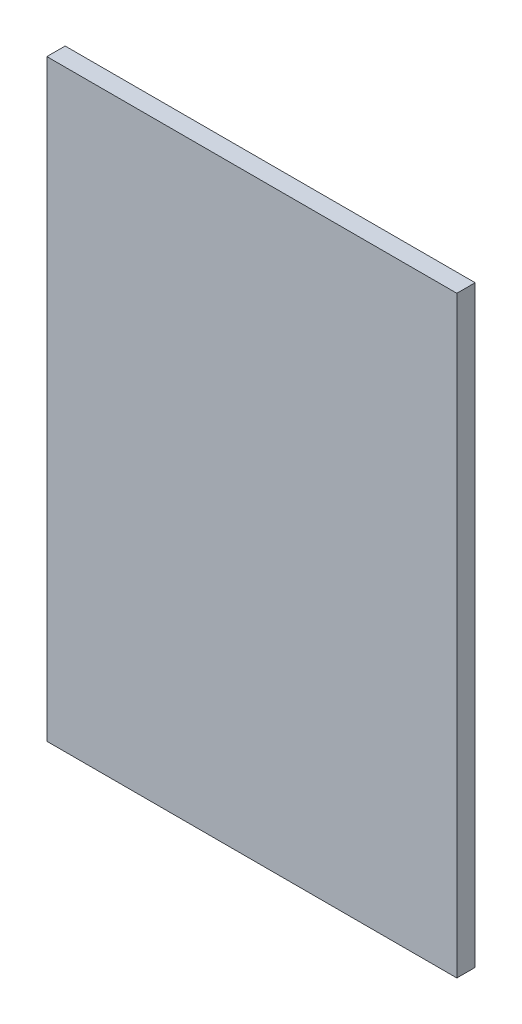
ISO-10303-21;
HEADER;
FILE_DESCRIPTION(('STEP AP214'),'2;1');
FILE_NAME('part.step','',(''),(''),'','','');
FILE_SCHEMA(('AUTOMOTIVE_DESIGN { 1 0 10303 214 1 1 1 1 }'));
ENDSEC;
DATA;
#1=APPLICATION_CONTEXT('core data for automotive mechanical design processes');
#2=APPLICATION_PROTOCOL_DEFINITION('international standard','automotive_design',2000,#1);
#3=PRODUCT_CONTEXT('',#1,'mechanical');
#4=PRODUCT('Part','Part','',(#3));
#5=PRODUCT_RELATED_PRODUCT_CATEGORY('part','',(#4));
#6=PRODUCT_DEFINITION_FORMATION('','',#4);
#7=PRODUCT_DEFINITION_CONTEXT('part definition',#1,'design');
#8=PRODUCT_DEFINITION('design','',#6,#7);
#9=PRODUCT_DEFINITION_SHAPE('','',#8);
#10=(LENGTH_UNIT() NAMED_UNIT(*) SI_UNIT(.MILLI.,.METRE.));
#11=(NAMED_UNIT(*) PLANE_ANGLE_UNIT() SI_UNIT($,.RADIAN.));
#12=(NAMED_UNIT(*) SI_UNIT($,.STERADIAN.) SOLID_ANGLE_UNIT());
#13=UNCERTAINTY_MEASURE_WITH_UNIT(LENGTH_MEASURE(1.E-05),#10,'distance_accuracy_value','');
#14=(GEOMETRIC_REPRESENTATION_CONTEXT(3) GLOBAL_UNCERTAINTY_ASSIGNED_CONTEXT((#13)) GLOBAL_UNIT_ASSIGNED_CONTEXT((#10,
#11,#12)) REPRESENTATION_CONTEXT('',''));
#15=CARTESIAN_POINT('',(0.,0.,0.));
#16=DIRECTION('',(0.,0.,1.));
#17=DIRECTION('',(1.,0.,0.));
#18=AXIS2_PLACEMENT_3D('',#15,#16,#17);
#19=CARTESIAN_POINT('',(56.896,0.,2.54));
#20=DIRECTION('',(0.,1.,0.));
#21=DIRECTION('',(0.,0.,1.));
#22=AXIS2_PLACEMENT_3D('',#19,#20,#21);
#23=PLANE('',#22);
#24=DIRECTION('',(1.,0.,0.));
#25=VECTOR('',#24,1.);
#26=CARTESIAN_POINT('',(56.896,0.,0.));
#27=LINE('',#26,#25);
#28=CARTESIAN_POINT('',(0.,0.,0.));
#29=VERTEX_POINT('',#28);
#30=CARTESIAN_POINT('',(56.896,0.,0.));
#31=VERTEX_POINT('',#30);
#32=EDGE_CURVE('E111',#29,#31,#27,.T.);
#33=ORIENTED_EDGE('',*,*,#32,.T.);
#34=DIRECTION('',(0.,0.,-1.));
#35=VECTOR('',#34,1.);
#36=CARTESIAN_POINT('',(56.896,0.,2.54));
#37=LINE('',#36,#35);
#38=CARTESIAN_POINT('',(56.896,0.,2.54));
#39=VERTEX_POINT('',#38);
#40=EDGE_CURVE('E11',#39,#31,#37,.T.);
#41=ORIENTED_EDGE('',*,*,#40,.F.);
#42=DIRECTION('',(1.,0.,0.));
#43=VECTOR('',#42,1.);
#44=CARTESIAN_POINT('',(56.896,0.,2.54));
#45=LINE('',#44,#43);
#46=CARTESIAN_POINT('',(0.,0.,2.54));
#47=VERTEX_POINT('',#46);
#48=EDGE_CURVE('E95',#47,#39,#45,.T.);
#49=ORIENTED_EDGE('',*,*,#48,.F.);
#50=DIRECTION('',(0.,0.,-1.));
#51=VECTOR('',#50,1.);
#52=CARTESIAN_POINT('',(0.,0.,2.54));
#53=LINE('',#52,#51);
#54=EDGE_CURVE('E107',#47,#29,#53,.T.);
#55=ORIENTED_EDGE('',*,*,#54,.T.);
#56=EDGE_LOOP('',(#33,#41,#49,#55));
#57=FACE_BOUND('',#56,.T.);
#58=ADVANCED_FACE('F43',(#57),#23,.F.);
#59=CARTESIAN_POINT('',(56.896,82.296,2.54));
#60=DIRECTION('',(-1.,0.,0.));
#61=DIRECTION('',(0.,0.,1.));
#62=AXIS2_PLACEMENT_3D('',#59,#60,#61);
#63=PLANE('',#62);
#64=DIRECTION('',(0.,1.,0.));
#65=VECTOR('',#64,1.);
#66=CARTESIAN_POINT('',(56.896,82.296,0.));
#67=LINE('',#66,#65);
#68=CARTESIAN_POINT('',(56.896,82.296,0.));
#69=VERTEX_POINT('',#68);
#70=EDGE_CURVE('E100',#31,#69,#67,.T.);
#71=ORIENTED_EDGE('',*,*,#70,.T.);
#72=DIRECTION('',(0.,0.,-1.));
#73=VECTOR('',#72,1.);
#74=CARTESIAN_POINT('',(56.896,82.296,2.54));
#75=LINE('',#74,#73);
#76=CARTESIAN_POINT('',(56.896,82.296,2.54));
#77=VERTEX_POINT('',#76);
#78=EDGE_CURVE('E52',#77,#69,#75,.T.);
#79=ORIENTED_EDGE('',*,*,#78,.F.);
#80=DIRECTION('',(0.,1.,0.));
#81=VECTOR('',#80,1.);
#82=CARTESIAN_POINT('',(56.896,82.296,2.54));
#83=LINE('',#82,#81);
#84=EDGE_CURVE('E90',#39,#77,#83,.T.);
#85=ORIENTED_EDGE('',*,*,#84,.F.);
#86=ORIENTED_EDGE('',*,*,#40,.T.);
#87=EDGE_LOOP('',(#71,#79,#85,#86));
#88=FACE_BOUND('',#87,.T.);
#89=ADVANCED_FACE('F99',(#88),#63,.F.);
#90=CARTESIAN_POINT('',(0.,82.296,2.54));
#91=DIRECTION('',(0.,-1.,0.));
#92=DIRECTION('',(0.,0.,-1.));
#93=AXIS2_PLACEMENT_3D('',#90,#91,#92);
#94=PLANE('',#93);
#95=DIRECTION('',(-1.,0.,0.));
#96=VECTOR('',#95,1.);
#97=CARTESIAN_POINT('',(0.,82.296,0.));
#98=LINE('',#97,#96);
#99=CARTESIAN_POINT('',(0.,82.296,0.));
#100=VERTEX_POINT('',#99);
#101=EDGE_CURVE('E77',#69,#100,#98,.T.);
#102=ORIENTED_EDGE('',*,*,#101,.T.);
#103=DIRECTION('',(0.,0.,-1.));
#104=VECTOR('',#103,1.);
#105=CARTESIAN_POINT('',(0.,82.296,2.54));
#106=LINE('',#105,#104);
#107=CARTESIAN_POINT('',(0.,82.296,2.54));
#108=VERTEX_POINT('',#107);
#109=EDGE_CURVE('E102',#108,#100,#106,.T.);
#110=ORIENTED_EDGE('',*,*,#109,.F.);
#111=DIRECTION('',(-1.,0.,0.));
#112=VECTOR('',#111,1.);
#113=CARTESIAN_POINT('',(0.,82.296,2.54));
#114=LINE('',#113,#112);
#115=EDGE_CURVE('E93',#77,#108,#114,.T.);
#116=ORIENTED_EDGE('',*,*,#115,.F.);
#117=ORIENTED_EDGE('',*,*,#78,.T.);
#118=EDGE_LOOP('',(#102,#110,#116,#117));
#119=FACE_BOUND('',#118,.T.);
#120=ADVANCED_FACE('F103',(#119),#94,.F.);
#121=CARTESIAN_POINT('',(0.,0.,2.54));
#122=DIRECTION('',(1.,0.,0.));
#123=DIRECTION('',(0.,0.,-1.));
#124=AXIS2_PLACEMENT_3D('',#121,#122,#123);
#125=PLANE('',#124);
#126=DIRECTION('',(0.,-1.,0.));
#127=VECTOR('',#126,1.);
#128=CARTESIAN_POINT('',(0.,0.,0.));
#129=LINE('',#128,#127);
#130=EDGE_CURVE('E83',#100,#29,#129,.T.);
#131=ORIENTED_EDGE('',*,*,#130,.T.);
#132=ORIENTED_EDGE('',*,*,#54,.F.);
#133=DIRECTION('',(0.,-1.,0.));
#134=VECTOR('',#133,1.);
#135=CARTESIAN_POINT('',(0.,0.,2.54));
#136=LINE('',#135,#134);
#137=EDGE_CURVE('E60',#108,#47,#136,.T.);
#138=ORIENTED_EDGE('',*,*,#137,.F.);
#139=ORIENTED_EDGE('',*,*,#109,.T.);
#140=EDGE_LOOP('',(#131,#132,#138,#139));
#141=FACE_BOUND('',#140,.T.);
#142=ADVANCED_FACE('F124',(#141),#125,.F.);
#143=CARTESIAN_POINT('',(0.,0.,2.54));
#144=DIRECTION('',(0.,0.,-1.));
#145=DIRECTION('',(-1.,0.,0.));
#146=AXIS2_PLACEMENT_3D('',#143,#144,#145);
#147=PLANE('',#146);
#148=ORIENTED_EDGE('',*,*,#48,.T.);
#149=ORIENTED_EDGE('',*,*,#84,.T.);
#150=ORIENTED_EDGE('',*,*,#115,.T.);
#151=ORIENTED_EDGE('',*,*,#137,.T.);
#152=EDGE_LOOP('',(#148,#149,#150,#151));
#153=FACE_BOUND('',#152,.T.);
#154=ADVANCED_FACE('F91',(#153),#147,.F.);
#155=CARTESIAN_POINT('',(0.,0.,0.));
#156=DIRECTION('',(0.,0.,-1.));
#157=DIRECTION('',(-1.,0.,0.));
#158=AXIS2_PLACEMENT_3D('',#155,#156,#157);
#159=PLANE('',#158);
#160=ORIENTED_EDGE('',*,*,#32,.F.);
#161=ORIENTED_EDGE('',*,*,#130,.F.);
#162=ORIENTED_EDGE('',*,*,#101,.F.);
#163=ORIENTED_EDGE('',*,*,#70,.F.);
#164=EDGE_LOOP('',(#160,#161,#162,#163));
#165=FACE_BOUND('',#164,.T.);
#166=ADVANCED_FACE('F127',(#165),#159,.T.);
#167=CLOSED_SHELL('',(#58,#89,#120,#142,#154,#166));
#168=MANIFOLD_SOLID_BREP('B2',#167);
#169=ADVANCED_BREP_SHAPE_REPRESENTATION('',(#18,#168),#14);
#170=SHAPE_DEFINITION_REPRESENTATION(#9,#169);
ENDSEC;
END-ISO-10303-21;
